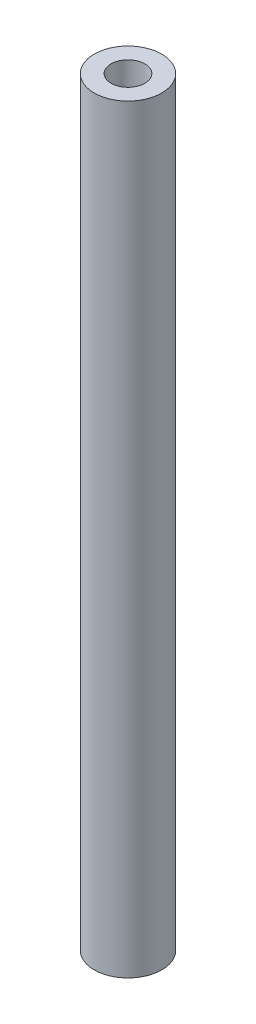
ISO-10303-21;
HEADER;
FILE_DESCRIPTION(('STEP AP214'),'2;1');
FILE_NAME('part.step','',(''),(''),'','','');
FILE_SCHEMA(('AUTOMOTIVE_DESIGN { 1 0 10303 214 1 1 1 1 }'));
ENDSEC;
DATA;
#1=APPLICATION_CONTEXT('core data for automotive mechanical design processes');
#2=APPLICATION_PROTOCOL_DEFINITION('international standard','automotive_design',2000,#1);
#3=PRODUCT_CONTEXT('',#1,'mechanical');
#4=PRODUCT('Part','Part','',(#3));
#5=PRODUCT_RELATED_PRODUCT_CATEGORY('part','',(#4));
#6=PRODUCT_DEFINITION_FORMATION('','',#4);
#7=PRODUCT_DEFINITION_CONTEXT('part definition',#1,'design');
#8=PRODUCT_DEFINITION('design','',#6,#7);
#9=PRODUCT_DEFINITION_SHAPE('','',#8);
#10=(LENGTH_UNIT() NAMED_UNIT(*) SI_UNIT(.MILLI.,.METRE.));
#11=(NAMED_UNIT(*) PLANE_ANGLE_UNIT() SI_UNIT($,.RADIAN.));
#12=(NAMED_UNIT(*) SI_UNIT($,.STERADIAN.) SOLID_ANGLE_UNIT());
#13=UNCERTAINTY_MEASURE_WITH_UNIT(LENGTH_MEASURE(1.E-05),#10,'distance_accuracy_value','');
#14=(GEOMETRIC_REPRESENTATION_CONTEXT(3) GLOBAL_UNCERTAINTY_ASSIGNED_CONTEXT((#13)) GLOBAL_UNIT_ASSIGNED_CONTEXT((#10,
#11,#12)) REPRESENTATION_CONTEXT('',''));
#15=CARTESIAN_POINT('',(0.,0.,0.));
#16=DIRECTION('',(0.,0.,1.));
#17=DIRECTION('',(1.,0.,0.));
#18=AXIS2_PLACEMENT_3D('',#15,#16,#17);
#19=CARTESIAN_POINT('',(0.,90.,0.));
#20=DIRECTION('',(0.,1.,0.));
#21=DIRECTION('',(0.,0.,1.));
#22=AXIS2_PLACEMENT_3D('',#19,#20,#21);
#23=PLANE('',#22);
#24=CARTESIAN_POINT('',(0.,90.,0.));
#25=DIRECTION('',(0.,1.,0.));
#26=DIRECTION('',(0.,0.,1.));
#27=AXIS2_PLACEMENT_3D('',#24,#25,#26);
#28=CIRCLE('',#27,4.);
#29=CARTESIAN_POINT('',(0.,90.,4.));
#30=VERTEX_POINT('',#29);
#31=EDGE_CURVE('E10',#30,#30,#28,.T.);
#32=ORIENTED_EDGE('',*,*,#31,.T.);
#33=EDGE_LOOP('',(#32));
#34=FACE_BOUND('',#33,.T.);
#35=CARTESIAN_POINT('',(0.,90.,0.));
#36=DIRECTION('',(0.,1.,0.));
#37=DIRECTION('',(0.,0.,1.));
#38=AXIS2_PLACEMENT_3D('',#35,#36,#37);
#39=CIRCLE('',#38,2.);
#40=CARTESIAN_POINT('',(0.,90.,2.));
#41=VERTEX_POINT('',#40);
#42=EDGE_CURVE('E45',#41,#41,#39,.T.);
#43=ORIENTED_EDGE('',*,*,#42,.F.);
#44=EDGE_LOOP('',(#43));
#45=FACE_BOUND('',#44,.T.);
#46=ADVANCED_FACE('F34',(#34,#45),#23,.T.);
#47=CARTESIAN_POINT('',(0.,0.,0.));
#48=DIRECTION('',(0.,1.,0.));
#49=DIRECTION('',(0.,0.,1.));
#50=AXIS2_PLACEMENT_3D('',#47,#48,#49);
#51=PLANE('',#50);
#52=CARTESIAN_POINT('',(0.,0.,0.));
#53=DIRECTION('',(0.,1.,0.));
#54=DIRECTION('',(0.,0.,1.));
#55=AXIS2_PLACEMENT_3D('',#52,#53,#54);
#56=CIRCLE('',#55,4.);
#57=CARTESIAN_POINT('',(0.,0.,4.));
#58=VERTEX_POINT('',#57);
#59=EDGE_CURVE('E38',#58,#58,#56,.T.);
#60=ORIENTED_EDGE('',*,*,#59,.F.);
#61=EDGE_LOOP('',(#60));
#62=FACE_BOUND('',#61,.T.);
#63=CARTESIAN_POINT('',(0.,0.,0.));
#64=DIRECTION('',(0.,1.,0.));
#65=DIRECTION('',(0.,0.,1.));
#66=AXIS2_PLACEMENT_3D('',#63,#64,#65);
#67=CIRCLE('',#66,2.);
#68=CARTESIAN_POINT('',(0.,0.,2.));
#69=VERTEX_POINT('',#68);
#70=EDGE_CURVE('E47',#69,#69,#67,.T.);
#71=ORIENTED_EDGE('',*,*,#70,.T.);
#72=EDGE_LOOP('',(#71));
#73=FACE_BOUND('',#72,.T.);
#74=ADVANCED_FACE('F57',(#62,#73),#51,.F.);
#75=CARTESIAN_POINT('',(0.,90.,0.));
#76=DIRECTION('',(0.,-1.,0.));
#77=DIRECTION('',(0.,0.,-1.));
#78=AXIS2_PLACEMENT_3D('',#75,#76,#77);
#79=CYLINDRICAL_SURFACE('',#78,4.);
#80=ORIENTED_EDGE('',*,*,#31,.F.);
#81=EDGE_LOOP('',(#80));
#82=FACE_BOUND('',#81,.T.);
#83=ORIENTED_EDGE('',*,*,#59,.T.);
#84=EDGE_LOOP('',(#83));
#85=FACE_BOUND('',#84,.T.);
#86=ADVANCED_FACE('F36',(#82,#85),#79,.T.);
#87=CARTESIAN_POINT('',(0.,90.,0.));
#88=DIRECTION('',(0.,-1.,0.));
#89=DIRECTION('',(0.,0.,-1.));
#90=AXIS2_PLACEMENT_3D('',#87,#88,#89);
#91=CYLINDRICAL_SURFACE('',#90,2.);
#92=ORIENTED_EDGE('',*,*,#42,.T.);
#93=EDGE_LOOP('',(#92));
#94=FACE_BOUND('',#93,.T.);
#95=ORIENTED_EDGE('',*,*,#70,.F.);
#96=EDGE_LOOP('',(#95));
#97=FACE_BOUND('',#96,.T.);
#98=ADVANCED_FACE('F53',(#94,#97),#91,.F.);
#99=CLOSED_SHELL('',(#46,#74,#86,#98));
#100=MANIFOLD_SOLID_BREP('B2',#99);
#101=ADVANCED_BREP_SHAPE_REPRESENTATION('',(#18,#100),#14);
#102=SHAPE_DEFINITION_REPRESENTATION(#9,#101);
ENDSEC;
END-ISO-10303-21;
